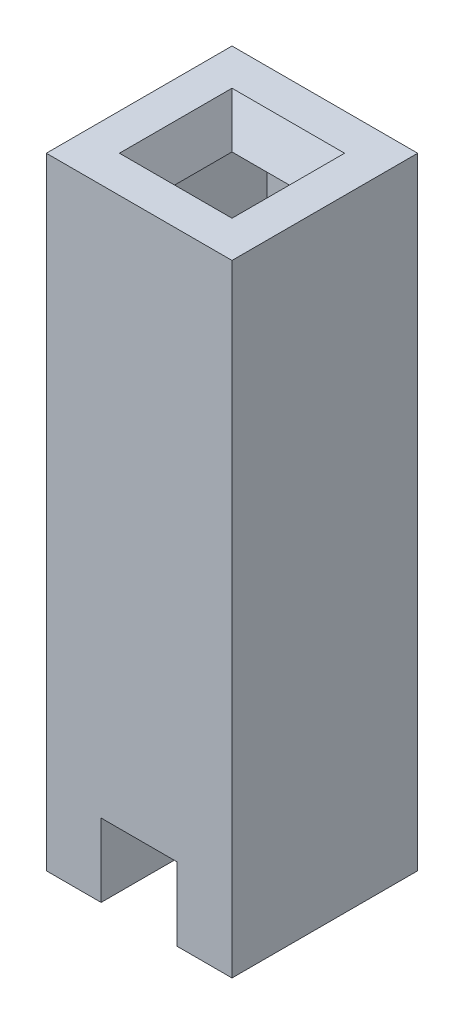
ISO-10303-21;
HEADER;
FILE_DESCRIPTION(('STEP AP214'),'2;1');
FILE_NAME('part.step','',(''),(''),'','','');
FILE_SCHEMA(('AUTOMOTIVE_DESIGN { 1 0 10303 214 1 1 1 1 }'));
ENDSEC;
DATA;
#1=APPLICATION_CONTEXT('core data for automotive mechanical design processes');
#2=APPLICATION_PROTOCOL_DEFINITION('international standard','automotive_design',2000,#1);
#3=PRODUCT_CONTEXT('',#1,'mechanical');
#4=PRODUCT('Part','Part','',(#3));
#5=PRODUCT_RELATED_PRODUCT_CATEGORY('part','',(#4));
#6=PRODUCT_DEFINITION_FORMATION('','',#4);
#7=PRODUCT_DEFINITION_CONTEXT('part definition',#1,'design');
#8=PRODUCT_DEFINITION('design','',#6,#7);
#9=PRODUCT_DEFINITION_SHAPE('','',#8);
#10=(LENGTH_UNIT() NAMED_UNIT(*) SI_UNIT(.MILLI.,.METRE.));
#11=(NAMED_UNIT(*) PLANE_ANGLE_UNIT() SI_UNIT($,.RADIAN.));
#12=(NAMED_UNIT(*) SI_UNIT($,.STERADIAN.) SOLID_ANGLE_UNIT());
#13=UNCERTAINTY_MEASURE_WITH_UNIT(LENGTH_MEASURE(1.E-05),#10,'distance_accuracy_value','');
#14=(GEOMETRIC_REPRESENTATION_CONTEXT(3) GLOBAL_UNCERTAINTY_ASSIGNED_CONTEXT((#13)) GLOBAL_UNIT_ASSIGNED_CONTEXT((#10,
#11,#12)) REPRESENTATION_CONTEXT('',''));
#15=CARTESIAN_POINT('',(0.,0.,0.));
#16=DIRECTION('',(0.,0.,1.));
#17=DIRECTION('',(1.,0.,0.));
#18=AXIS2_PLACEMENT_3D('',#15,#16,#17);
#19=CARTESIAN_POINT('',(-0.75,1.,2.54));
#20=DIRECTION('',(0.,1.,0.));
#21=DIRECTION('',(-1.,0.,0.));
#22=AXIS2_PLACEMENT_3D('',#19,#20,#21);
#23=PLANE('',#22);
#24=DIRECTION('',(0.,0.,-1.));
#25=VECTOR('',#24,1.);
#26=CARTESIAN_POINT('',(-1.79,1.,2.54));
#27=LINE('',#26,#25);
#28=CARTESIAN_POINT('',(-1.79,1.,2.54));
#29=VERTEX_POINT('',#28);
#30=CARTESIAN_POINT('',(-1.79,1.,2.27));
#31=VERTEX_POINT('',#30);
#32=EDGE_CURVE('E254',#29,#31,#27,.T.);
#33=ORIENTED_EDGE('',*,*,#32,.T.);
#34=DIRECTION('',(-1.,0.,0.));
#35=VECTOR('',#34,1.);
#36=CARTESIAN_POINT('',(-1.79,1.,2.27));
#37=LINE('',#36,#35);
#38=CARTESIAN_POINT('',(-0.75,1.,2.27));
#39=VERTEX_POINT('',#38);
#40=EDGE_CURVE('E195',#39,#31,#37,.T.);
#41=ORIENTED_EDGE('',*,*,#40,.F.);
#42=DIRECTION('',(0.,0.,-1.));
#43=VECTOR('',#42,1.);
#44=CARTESIAN_POINT('',(-0.75,1.,2.54));
#45=LINE('',#44,#43);
#46=CARTESIAN_POINT('',(-0.75,1.,2.54));
#47=VERTEX_POINT('',#46);
#48=EDGE_CURVE('E250',#47,#39,#45,.T.);
#49=ORIENTED_EDGE('',*,*,#48,.F.);
#50=DIRECTION('',(1.,0.,0.));
#51=VECTOR('',#50,1.);
#52=CARTESIAN_POINT('',(-0.75,1.,2.54));
#53=LINE('',#52,#51);
#54=EDGE_CURVE('E220',#29,#47,#53,.T.);
#55=ORIENTED_EDGE('',*,*,#54,.F.);
#56=EDGE_LOOP('',(#33,#41,#49,#55));
#57=FACE_BOUND('',#56,.T.);
#58=ADVANCED_FACE('F34',(#57),#23,.F.);
#59=CARTESIAN_POINT('',(0.,0.,2.54));
#60=DIRECTION('',(-1.,0.,0.));
#61=DIRECTION('',(0.,-1.,0.));
#62=AXIS2_PLACEMENT_3D('',#59,#60,#61);
#63=PLANE('',#62);
#64=DIRECTION('',(0.,1.,0.));
#65=VECTOR('',#64,1.);
#66=CARTESIAN_POINT('',(0.,0.,0.));
#67=LINE('',#66,#65);
#68=CARTESIAN_POINT('',(0.,0.,0.));
#69=VERTEX_POINT('',#68);
#70=CARTESIAN_POINT('',(0.,8.5,0.));
#71=VERTEX_POINT('',#70);
#72=EDGE_CURVE('E207',#69,#71,#67,.T.);
#73=ORIENTED_EDGE('',*,*,#72,.T.);
#74=DIRECTION('',(0.,0.,-1.));
#75=VECTOR('',#74,1.);
#76=CARTESIAN_POINT('',(0.,8.5,2.54));
#77=LINE('',#76,#75);
#78=CARTESIAN_POINT('',(0.,8.5,2.54));
#79=VERTEX_POINT('',#78);
#80=EDGE_CURVE('E12',#79,#71,#77,.T.);
#81=ORIENTED_EDGE('',*,*,#80,.F.);
#82=DIRECTION('',(0.,1.,0.));
#83=VECTOR('',#82,1.);
#84=CARTESIAN_POINT('',(0.,0.,2.54));
#85=LINE('',#84,#83);
#86=CARTESIAN_POINT('',(0.,0.,2.54));
#87=VERTEX_POINT('',#86);
#88=EDGE_CURVE('E208',#87,#79,#85,.T.);
#89=ORIENTED_EDGE('',*,*,#88,.F.);
#90=DIRECTION('',(0.,0.,-1.));
#91=VECTOR('',#90,1.);
#92=CARTESIAN_POINT('',(0.,0.,2.54));
#93=LINE('',#92,#91);
#94=EDGE_CURVE('E226',#87,#69,#93,.T.);
#95=ORIENTED_EDGE('',*,*,#94,.T.);
#96=EDGE_LOOP('',(#73,#81,#89,#95));
#97=FACE_BOUND('',#96,.T.);
#98=ADVANCED_FACE('F36',(#97),#63,.F.);
#99=CARTESIAN_POINT('',(0.,8.5,2.54));
#100=DIRECTION('',(0.,-1.,0.));
#101=DIRECTION('',(0.,0.,-1.));
#102=AXIS2_PLACEMENT_3D('',#99,#100,#101);
#103=PLANE('',#102);
#104=DIRECTION('',(-1.,0.,0.));
#105=VECTOR('',#104,1.);
#106=CARTESIAN_POINT('',(-0.5,8.5,0.5));
#107=LINE('',#106,#105);
#108=CARTESIAN_POINT('',(-0.5,8.5,0.5));
#109=VERTEX_POINT('',#108);
#110=CARTESIAN_POINT('',(-2.04,8.5,0.5));
#111=VERTEX_POINT('',#110);
#112=EDGE_CURVE('E170',#109,#111,#107,.T.);
#113=ORIENTED_EDGE('',*,*,#112,.F.);
#114=DIRECTION('',(0.,0.,-1.));
#115=VECTOR('',#114,1.);
#116=CARTESIAN_POINT('',(-0.5,8.5,2.04));
#117=LINE('',#116,#115);
#118=CARTESIAN_POINT('',(-0.5,8.5,2.04));
#119=VERTEX_POINT('',#118);
#120=EDGE_CURVE('E49',#119,#109,#117,.T.);
#121=ORIENTED_EDGE('',*,*,#120,.F.);
#122=DIRECTION('',(1.,0.,0.));
#123=VECTOR('',#122,1.);
#124=CARTESIAN_POINT('',(-2.04,8.5,2.04));
#125=LINE('',#124,#123);
#126=CARTESIAN_POINT('',(-2.04,8.5,2.04));
#127=VERTEX_POINT('',#126);
#128=EDGE_CURVE('E157',#127,#119,#125,.T.);
#129=ORIENTED_EDGE('',*,*,#128,.F.);
#130=DIRECTION('',(0.,0.,1.));
#131=VECTOR('',#130,1.);
#132=CARTESIAN_POINT('',(-2.04,8.5,0.5));
#133=LINE('',#132,#131);
#134=EDGE_CURVE('E165',#111,#127,#133,.T.);
#135=ORIENTED_EDGE('',*,*,#134,.F.);
#136=EDGE_LOOP('',(#113,#121,#129,#135));
#137=FACE_BOUND('',#136,.T.);
#138=DIRECTION('',(-1.,0.,0.));
#139=VECTOR('',#138,1.);
#140=CARTESIAN_POINT('',(0.,8.5,0.));
#141=LINE('',#140,#139);
#142=CARTESIAN_POINT('',(-2.54,8.5,0.));
#143=VERTEX_POINT('',#142);
#144=EDGE_CURVE('E229',#71,#143,#141,.T.);
#145=ORIENTED_EDGE('',*,*,#144,.T.);
#146=DIRECTION('',(0.,0.,-1.));
#147=VECTOR('',#146,1.);
#148=CARTESIAN_POINT('',(-2.54,8.5,2.54));
#149=LINE('',#148,#147);
#150=CARTESIAN_POINT('',(-2.54,8.5,2.54));
#151=VERTEX_POINT('',#150);
#152=EDGE_CURVE('E42',#151,#143,#149,.T.);
#153=ORIENTED_EDGE('',*,*,#152,.F.);
#154=DIRECTION('',(-1.,0.,0.));
#155=VECTOR('',#154,1.);
#156=CARTESIAN_POINT('',(0.,8.5,2.54));
#157=LINE('',#156,#155);
#158=EDGE_CURVE('E211',#79,#151,#157,.T.);
#159=ORIENTED_EDGE('',*,*,#158,.F.);
#160=ORIENTED_EDGE('',*,*,#80,.T.);
#161=EDGE_LOOP('',(#145,#153,#159,#160));
#162=FACE_BOUND('',#161,.T.);
#163=ADVANCED_FACE('F168',(#137,#162),#103,.F.);
#164=CARTESIAN_POINT('',(-2.54,0.,2.54));
#165=DIRECTION('',(1.,0.,0.));
#166=DIRECTION('',(0.,0.,-1.));
#167=AXIS2_PLACEMENT_3D('',#164,#165,#166);
#168=PLANE('',#167);
#169=DIRECTION('',(0.,-1.,0.));
#170=VECTOR('',#169,1.);
#171=CARTESIAN_POINT('',(-2.54,0.,0.));
#172=LINE('',#171,#170);
#173=CARTESIAN_POINT('',(-2.54,0.,0.));
#174=VERTEX_POINT('',#173);
#175=EDGE_CURVE('E231',#143,#174,#172,.T.);
#176=ORIENTED_EDGE('',*,*,#175,.T.);
#177=DIRECTION('',(0.,0.,-1.));
#178=VECTOR('',#177,1.);
#179=CARTESIAN_POINT('',(-2.54,0.,2.54));
#180=LINE('',#179,#178);
#181=CARTESIAN_POINT('',(-2.54,0.,2.54));
#182=VERTEX_POINT('',#181);
#183=EDGE_CURVE('E260',#182,#174,#180,.T.);
#184=ORIENTED_EDGE('',*,*,#183,.F.);
#185=DIRECTION('',(0.,-1.,0.));
#186=VECTOR('',#185,1.);
#187=CARTESIAN_POINT('',(-2.54,0.,2.54));
#188=LINE('',#187,#186);
#189=EDGE_CURVE('E214',#151,#182,#188,.T.);
#190=ORIENTED_EDGE('',*,*,#189,.F.);
#191=ORIENTED_EDGE('',*,*,#152,.T.);
#192=EDGE_LOOP('',(#176,#184,#190,#191));
#193=FACE_BOUND('',#192,.T.);
#194=ADVANCED_FACE('F267',(#193),#168,.F.);
#195=CARTESIAN_POINT('',(-1.79,0.,2.54));
#196=DIRECTION('',(0.,1.,0.));
#197=DIRECTION('',(-1.,0.,0.));
#198=AXIS2_PLACEMENT_3D('',#195,#196,#197);
#199=PLANE('',#198);
#200=DIRECTION('',(1.,0.,0.));
#201=VECTOR('',#200,1.);
#202=CARTESIAN_POINT('',(-1.79,0.,0.));
#203=LINE('',#202,#201);
#204=CARTESIAN_POINT('',(-1.79,0.,0.));
#205=VERTEX_POINT('',#204);
#206=EDGE_CURVE('E233',#174,#205,#203,.T.);
#207=ORIENTED_EDGE('',*,*,#206,.T.);
#208=DIRECTION('',(0.,0.,-1.));
#209=VECTOR('',#208,1.);
#210=CARTESIAN_POINT('',(-1.79,0.,2.54));
#211=LINE('',#210,#209);
#212=CARTESIAN_POINT('',(-1.79,0.,2.54));
#213=VERTEX_POINT('',#212);
#214=EDGE_CURVE('E257',#213,#205,#211,.T.);
#215=ORIENTED_EDGE('',*,*,#214,.F.);
#216=DIRECTION('',(1.,0.,0.));
#217=VECTOR('',#216,1.);
#218=CARTESIAN_POINT('',(-1.79,0.,2.54));
#219=LINE('',#218,#217);
#220=EDGE_CURVE('E216',#182,#213,#219,.T.);
#221=ORIENTED_EDGE('',*,*,#220,.F.);
#222=ORIENTED_EDGE('',*,*,#183,.T.);
#223=EDGE_LOOP('',(#207,#215,#221,#222));
#224=FACE_BOUND('',#223,.T.);
#225=ADVANCED_FACE('F277',(#224),#199,.F.);
#226=CARTESIAN_POINT('',(-1.79,0.,2.54));
#227=DIRECTION('',(-1.,0.,0.));
#228=DIRECTION('',(0.,0.,1.));
#229=AXIS2_PLACEMENT_3D('',#226,#227,#228);
#230=PLANE('',#229);
#231=DIRECTION('',(0.,1.,0.));
#232=VECTOR('',#231,1.);
#233=CARTESIAN_POINT('',(-1.79,0.,0.));
#234=LINE('',#233,#232);
#235=CARTESIAN_POINT('',(-1.79,1.,0.));
#236=VERTEX_POINT('',#235);
#237=EDGE_CURVE('E235',#205,#236,#234,.T.);
#238=ORIENTED_EDGE('',*,*,#237,.T.);
#239=CARTESIAN_POINT('',(-1.79,1.,0.27));
#240=VERTEX_POINT('',#239);
#241=EDGE_CURVE('E253',#240,#236,#27,.T.);
#242=ORIENTED_EDGE('',*,*,#241,.F.);
#243=DIRECTION('',(0.,-1.,0.));
#244=VECTOR('',#243,1.);
#245=CARTESIAN_POINT('',(-1.79,10.7542404485769,0.27));
#246=LINE('',#245,#244);
#247=CARTESIAN_POINT('',(-1.79,8.,0.27));
#248=VERTEX_POINT('',#247);
#249=EDGE_CURVE('E198',#248,#240,#246,.T.);
#250=ORIENTED_EDGE('',*,*,#249,.F.);
#251=DIRECTION('',(0.,0.,1.));
#252=VECTOR('',#251,1.);
#253=CARTESIAN_POINT('',(-1.79,8.,2.27));
#254=LINE('',#253,#252);
#255=CARTESIAN_POINT('',(-1.79,8.,2.27));
#256=VERTEX_POINT('',#255);
#257=EDGE_CURVE('E191',#248,#256,#254,.T.);
#258=ORIENTED_EDGE('',*,*,#257,.T.);
#259=DIRECTION('',(0.,-1.,0.));
#260=VECTOR('',#259,1.);
#261=CARTESIAN_POINT('',(-1.79,10.7542404485769,2.27));
#262=LINE('',#261,#260);
#263=EDGE_CURVE('E189',#256,#31,#262,.T.);
#264=ORIENTED_EDGE('',*,*,#263,.T.);
#265=ORIENTED_EDGE('',*,*,#32,.F.);
#266=DIRECTION('',(0.,1.,0.));
#267=VECTOR('',#266,1.);
#268=CARTESIAN_POINT('',(-1.79,0.,2.54));
#269=LINE('',#268,#267);
#270=EDGE_CURVE('E218',#213,#29,#269,.T.);
#271=ORIENTED_EDGE('',*,*,#270,.F.);
#272=ORIENTED_EDGE('',*,*,#214,.T.);
#273=EDGE_LOOP('',(#238,#242,#250,#258,#264,#265,#271,#272));
#274=FACE_BOUND('',#273,.T.);
#275=ADVANCED_FACE('F281',(#274),#230,.F.);
#276=CARTESIAN_POINT('',(-0.75,1.,0.27));
#277=VERTEX_POINT('',#276);
#278=CARTESIAN_POINT('',(-0.75,1.,0.));
#279=VERTEX_POINT('',#278);
#280=EDGE_CURVE('E249',#277,#279,#45,.T.);
#281=ORIENTED_EDGE('',*,*,#280,.F.);
#282=DIRECTION('',(1.,0.,0.));
#283=VECTOR('',#282,1.);
#284=CARTESIAN_POINT('',(-1.79,1.,0.27));
#285=LINE('',#284,#283);
#286=EDGE_CURVE('E164',#240,#277,#285,.T.);
#287=ORIENTED_EDGE('',*,*,#286,.F.);
#288=ORIENTED_EDGE('',*,*,#241,.T.);
#289=DIRECTION('',(1.,0.,0.));
#290=VECTOR('',#289,1.);
#291=CARTESIAN_POINT('',(-0.75,1.,0.));
#292=LINE('',#291,#290);
#293=EDGE_CURVE('E238',#236,#279,#292,.T.);
#294=ORIENTED_EDGE('',*,*,#293,.T.);
#295=EDGE_LOOP('',(#281,#287,#288,#294));
#296=FACE_BOUND('',#295,.T.);
#297=ADVANCED_FACE('F305',(#296),#23,.F.);
#298=CARTESIAN_POINT('',(-0.75,0.,2.54));
#299=DIRECTION('',(1.,0.,0.));
#300=DIRECTION('',(0.,0.,-1.));
#301=AXIS2_PLACEMENT_3D('',#298,#299,#300);
#302=PLANE('',#301);
#303=DIRECTION('',(0.,-1.,0.));
#304=VECTOR('',#303,1.);
#305=CARTESIAN_POINT('',(-0.75,0.,0.));
#306=LINE('',#305,#304);
#307=CARTESIAN_POINT('',(-0.75,0.,0.));
#308=VERTEX_POINT('',#307);
#309=EDGE_CURVE('E241',#279,#308,#306,.T.);
#310=ORIENTED_EDGE('',*,*,#309,.T.);
#311=DIRECTION('',(0.,0.,-1.));
#312=VECTOR('',#311,1.);
#313=CARTESIAN_POINT('',(-0.75,0.,2.54));
#314=LINE('',#313,#312);
#315=CARTESIAN_POINT('',(-0.75,0.,2.54));
#316=VERTEX_POINT('',#315);
#317=EDGE_CURVE('E246',#316,#308,#314,.T.);
#318=ORIENTED_EDGE('',*,*,#317,.F.);
#319=DIRECTION('',(0.,-1.,0.));
#320=VECTOR('',#319,1.);
#321=CARTESIAN_POINT('',(-0.75,0.,2.54));
#322=LINE('',#321,#320);
#323=EDGE_CURVE('E222',#47,#316,#322,.T.);
#324=ORIENTED_EDGE('',*,*,#323,.F.);
#325=ORIENTED_EDGE('',*,*,#48,.T.);
#326=DIRECTION('',(0.,-1.,0.));
#327=VECTOR('',#326,1.);
#328=CARTESIAN_POINT('',(-0.750000000000002,10.7542404485769,2.27));
#329=LINE('',#328,#327);
#330=CARTESIAN_POINT('',(-0.750000000000002,8.,2.27));
#331=VERTEX_POINT('',#330);
#332=EDGE_CURVE('E200',#331,#39,#329,.T.);
#333=ORIENTED_EDGE('',*,*,#332,.F.);
#334=DIRECTION('',(0.,0.,-1.));
#335=VECTOR('',#334,1.);
#336=CARTESIAN_POINT('',(-0.750000000000002,8.,2.27));
#337=LINE('',#336,#335);
#338=CARTESIAN_POINT('',(-0.750000000000002,8.,0.27));
#339=VERTEX_POINT('',#338);
#340=EDGE_CURVE('E186',#331,#339,#337,.T.);
#341=ORIENTED_EDGE('',*,*,#340,.T.);
#342=DIRECTION('',(0.,-1.,0.));
#343=VECTOR('',#342,1.);
#344=CARTESIAN_POINT('',(-0.750000000000002,10.7542404485769,0.27));
#345=LINE('',#344,#343);
#346=EDGE_CURVE('E202',#339,#277,#345,.T.);
#347=ORIENTED_EDGE('',*,*,#346,.T.);
#348=ORIENTED_EDGE('',*,*,#280,.T.);
#349=EDGE_LOOP('',(#310,#318,#324,#325,#333,#341,#347,#348));
#350=FACE_BOUND('',#349,.T.);
#351=ADVANCED_FACE('F300',(#350),#302,.F.);
#352=CARTESIAN_POINT('',(0.,0.,2.54));
#353=DIRECTION('',(0.,1.,0.));
#354=DIRECTION('',(-1.,0.,0.));
#355=AXIS2_PLACEMENT_3D('',#352,#353,#354);
#356=PLANE('',#355);
#357=DIRECTION('',(1.,0.,0.));
#358=VECTOR('',#357,1.);
#359=CARTESIAN_POINT('',(0.,0.,0.));
#360=LINE('',#359,#358);
#361=EDGE_CURVE('E212',#308,#69,#360,.T.);
#362=ORIENTED_EDGE('',*,*,#361,.T.);
#363=ORIENTED_EDGE('',*,*,#94,.F.);
#364=DIRECTION('',(1.,0.,0.));
#365=VECTOR('',#364,1.);
#366=CARTESIAN_POINT('',(0.,0.,2.54));
#367=LINE('',#366,#365);
#368=EDGE_CURVE('E224',#316,#87,#367,.T.);
#369=ORIENTED_EDGE('',*,*,#368,.F.);
#370=ORIENTED_EDGE('',*,*,#317,.T.);
#371=EDGE_LOOP('',(#362,#363,#369,#370));
#372=FACE_BOUND('',#371,.T.);
#373=ADVANCED_FACE('F295',(#372),#356,.F.);
#374=CARTESIAN_POINT('',(0.,0.,2.54));
#375=DIRECTION('',(0.,0.,1.));
#376=DIRECTION('',(1.,0.,0.));
#377=AXIS2_PLACEMENT_3D('',#374,#375,#376);
#378=PLANE('',#377);
#379=ORIENTED_EDGE('',*,*,#88,.T.);
#380=ORIENTED_EDGE('',*,*,#158,.T.);
#381=ORIENTED_EDGE('',*,*,#189,.T.);
#382=ORIENTED_EDGE('',*,*,#220,.T.);
#383=ORIENTED_EDGE('',*,*,#270,.T.);
#384=ORIENTED_EDGE('',*,*,#54,.T.);
#385=ORIENTED_EDGE('',*,*,#323,.T.);
#386=ORIENTED_EDGE('',*,*,#368,.T.);
#387=EDGE_LOOP('',(#379,#380,#381,#382,#383,#384,#385,#386));
#388=FACE_BOUND('',#387,.T.);
#389=ADVANCED_FACE('F286',(#388),#378,.T.);
#390=CARTESIAN_POINT('',(0.,0.,0.));
#391=DIRECTION('',(0.,0.,1.));
#392=DIRECTION('',(1.,0.,0.));
#393=AXIS2_PLACEMENT_3D('',#390,#391,#392);
#394=PLANE('',#393);
#395=ORIENTED_EDGE('',*,*,#72,.F.);
#396=ORIENTED_EDGE('',*,*,#361,.F.);
#397=ORIENTED_EDGE('',*,*,#309,.F.);
#398=ORIENTED_EDGE('',*,*,#293,.F.);
#399=ORIENTED_EDGE('',*,*,#237,.F.);
#400=ORIENTED_EDGE('',*,*,#206,.F.);
#401=ORIENTED_EDGE('',*,*,#175,.F.);
#402=ORIENTED_EDGE('',*,*,#144,.F.);
#403=EDGE_LOOP('',(#395,#396,#397,#398,#399,#400,#401,#402));
#404=FACE_BOUND('',#403,.T.);
#405=ADVANCED_FACE('F272',(#404),#394,.F.);
#406=CARTESIAN_POINT('',(-1.79,10.7542404485769,2.27));
#407=DIRECTION('',(0.,0.,1.));
#408=DIRECTION('',(1.,0.,0.));
#409=AXIS2_PLACEMENT_3D('',#406,#407,#408);
#410=PLANE('',#409);
#411=DIRECTION('',(1.,0.,0.));
#412=VECTOR('',#411,1.);
#413=CARTESIAN_POINT('',(-1.79,8.,2.27));
#414=LINE('',#413,#412);
#415=EDGE_CURVE('E188',#256,#331,#414,.T.);
#416=ORIENTED_EDGE('',*,*,#415,.T.);
#417=ORIENTED_EDGE('',*,*,#332,.T.);
#418=ORIENTED_EDGE('',*,*,#40,.T.);
#419=ORIENTED_EDGE('',*,*,#263,.F.);
#420=EDGE_LOOP('',(#416,#417,#418,#419));
#421=FACE_BOUND('',#420,.T.);
#422=ADVANCED_FACE('F318',(#421),#410,.F.);
#423=CARTESIAN_POINT('',(-1.79,10.7542404485769,0.27));
#424=DIRECTION('',(0.,0.,-1.));
#425=DIRECTION('',(-1.,0.,0.));
#426=AXIS2_PLACEMENT_3D('',#423,#424,#425);
#427=PLANE('',#426);
#428=DIRECTION('',(-1.,0.,0.));
#429=VECTOR('',#428,1.);
#430=CARTESIAN_POINT('',(-1.79,8.,0.27));
#431=LINE('',#430,#429);
#432=EDGE_CURVE('E193',#339,#248,#431,.T.);
#433=ORIENTED_EDGE('',*,*,#432,.T.);
#434=ORIENTED_EDGE('',*,*,#249,.T.);
#435=ORIENTED_EDGE('',*,*,#286,.T.);
#436=ORIENTED_EDGE('',*,*,#346,.F.);
#437=EDGE_LOOP('',(#433,#434,#435,#436));
#438=FACE_BOUND('',#437,.T.);
#439=ADVANCED_FACE('F310',(#438),#427,.F.);
#440=CARTESIAN_POINT('',(0.,8.,2.54));
#441=DIRECTION('',(0.,-1.,0.));
#442=DIRECTION('',(0.,0.,-1.));
#443=AXIS2_PLACEMENT_3D('',#440,#441,#442);
#444=PLANE('',#443);
#445=DIRECTION('',(0.,0.,-1.));
#446=VECTOR('',#445,1.);
#447=CARTESIAN_POINT('',(-0.754762724747216,8.,2.04));
#448=LINE('',#447,#446);
#449=CARTESIAN_POINT('',(-0.754762724747216,8.,1.78523727525278));
#450=VERTEX_POINT('',#449);
#451=CARTESIAN_POINT('',(-0.754762724747216,8.,0.754762724747215));
#452=VERTEX_POINT('',#451);
#453=EDGE_CURVE('E150',#450,#452,#448,.T.);
#454=ORIENTED_EDGE('',*,*,#453,.T.);
#455=DIRECTION('',(-1.,0.,0.));
#456=VECTOR('',#455,1.);
#457=CARTESIAN_POINT('',(-0.5,8.,0.754762724747215));
#458=LINE('',#457,#456);
#459=CARTESIAN_POINT('',(-1.78523727525278,8.,0.754762724747215));
#460=VERTEX_POINT('',#459);
#461=EDGE_CURVE('E173',#452,#460,#458,.T.);
#462=ORIENTED_EDGE('',*,*,#461,.T.);
#463=DIRECTION('',(0.,0.,1.));
#464=VECTOR('',#463,1.);
#465=CARTESIAN_POINT('',(-1.78523727525279,8.,0.5));
#466=LINE('',#465,#464);
#467=CARTESIAN_POINT('',(-1.78523727525279,8.,1.78523727525278));
#468=VERTEX_POINT('',#467);
#469=EDGE_CURVE('E153',#460,#468,#466,.T.);
#470=ORIENTED_EDGE('',*,*,#469,.T.);
#471=DIRECTION('',(1.,0.,0.));
#472=VECTOR('',#471,1.);
#473=CARTESIAN_POINT('',(-2.04,8.,1.78523727525278));
#474=LINE('',#473,#472);
#475=EDGE_CURVE('E154',#468,#450,#474,.T.);
#476=ORIENTED_EDGE('',*,*,#475,.T.);
#477=EDGE_LOOP('',(#454,#462,#470,#476));
#478=FACE_BOUND('',#477,.T.);
#479=ORIENTED_EDGE('',*,*,#257,.F.);
#480=ORIENTED_EDGE('',*,*,#432,.F.);
#481=ORIENTED_EDGE('',*,*,#340,.F.);
#482=ORIENTED_EDGE('',*,*,#415,.F.);
#483=EDGE_LOOP('',(#479,#480,#481,#482));
#484=FACE_BOUND('',#483,.T.);
#485=ADVANCED_FACE('F314',(#478,#484),#444,.T.);
#486=CARTESIAN_POINT('',(-0.5,8.5,2.04));
#487=DIRECTION('',(0.891006524188367,-0.453990499739548,0.));
#488=DIRECTION('',(0.453990499739548,0.891006524188367,0.));
#489=AXIS2_PLACEMENT_3D('',#486,#487,#488);
#490=PLANE('',#489);
#491=DIRECTION('',(0.413384109704205,0.811311996514364,0.413384109704205));
#492=VECTOR('',#491,1.);
#493=CARTESIAN_POINT('',(-0.763165090120145,7.983509429448,1.77683490987986));
#494=LINE('',#493,#492);
#495=EDGE_CURVE('E146',#450,#119,#494,.T.);
#496=ORIENTED_EDGE('',*,*,#495,.T.);
#497=ORIENTED_EDGE('',*,*,#120,.T.);
#498=DIRECTION('',(0.413384109704205,0.811311996514364,-0.413384109704205));
#499=VECTOR('',#498,1.);
#500=CARTESIAN_POINT('',(-0.763165090120145,7.983509429448,0.763165090120145));
#501=LINE('',#500,#499);
#502=EDGE_CURVE('E180',#452,#109,#501,.T.);
#503=ORIENTED_EDGE('',*,*,#502,.F.);
#504=ORIENTED_EDGE('',*,*,#453,.F.);
#505=EDGE_LOOP('',(#496,#497,#503,#504));
#506=FACE_BOUND('',#505,.T.);
#507=ADVANCED_FACE('F148',(#506),#490,.F.);
#508=CARTESIAN_POINT('',(-2.04,8.5,2.04));
#509=DIRECTION('',(0.,-0.453990499739548,0.891006524188367));
#510=DIRECTION('',(0.,-0.891006524188367,-0.453990499739548));
#511=AXIS2_PLACEMENT_3D('',#508,#509,#510);
#512=PLANE('',#511);
#513=DIRECTION('',(-0.413384109704205,0.811311996514364,0.413384109704205));
#514=VECTOR('',#513,1.);
#515=CARTESIAN_POINT('',(-1.77683490987986,7.983509429448,1.77683490987986));
#516=LINE('',#515,#514);
#517=EDGE_CURVE('E160',#468,#127,#516,.T.);
#518=ORIENTED_EDGE('',*,*,#517,.T.);
#519=ORIENTED_EDGE('',*,*,#128,.T.);
#520=ORIENTED_EDGE('',*,*,#495,.F.);
#521=ORIENTED_EDGE('',*,*,#475,.F.);
#522=EDGE_LOOP('',(#518,#519,#520,#521));
#523=FACE_BOUND('',#522,.T.);
#524=ADVANCED_FACE('F158',(#523),#512,.F.);
#525=CARTESIAN_POINT('',(-2.04,8.5,0.5));
#526=DIRECTION('',(-0.891006524188367,-0.453990499739548,0.));
#527=DIRECTION('',(0.453990499739548,-0.891006524188367,0.));
#528=AXIS2_PLACEMENT_3D('',#525,#526,#527);
#529=PLANE('',#528);
#530=DIRECTION('',(-0.413384109704205,0.811311996514364,-0.413384109704205));
#531=VECTOR('',#530,1.);
#532=CARTESIAN_POINT('',(-1.77683490987986,7.983509429448,0.763165090120145));
#533=LINE('',#532,#531);
#534=EDGE_CURVE('E57',#460,#111,#533,.T.);
#535=ORIENTED_EDGE('',*,*,#534,.T.);
#536=ORIENTED_EDGE('',*,*,#134,.T.);
#537=ORIENTED_EDGE('',*,*,#517,.F.);
#538=ORIENTED_EDGE('',*,*,#469,.F.);
#539=EDGE_LOOP('',(#535,#536,#537,#538));
#540=FACE_BOUND('',#539,.T.);
#541=ADVANCED_FACE('F433',(#540),#529,.F.);
#542=CARTESIAN_POINT('',(-0.5,8.5,0.5));
#543=DIRECTION('',(0.,-0.453990499739548,-0.891006524188367));
#544=DIRECTION('',(0.,0.891006524188367,-0.453990499739548));
#545=AXIS2_PLACEMENT_3D('',#542,#543,#544);
#546=PLANE('',#545);
#547=ORIENTED_EDGE('',*,*,#502,.T.);
#548=ORIENTED_EDGE('',*,*,#112,.T.);
#549=ORIENTED_EDGE('',*,*,#534,.F.);
#550=ORIENTED_EDGE('',*,*,#461,.F.);
#551=EDGE_LOOP('',(#547,#548,#549,#550));
#552=FACE_BOUND('',#551,.T.);
#553=ADVANCED_FACE('F440',(#552),#546,.F.);
#554=CLOSED_SHELL('',(#58,#98,#163,#194,#225,#275,#297,#351,#373,#389,#405,#422,#439,#485,#507,
#524,#541,#553));
#555=MANIFOLD_SOLID_BREP('B2',#554);
#556=ADVANCED_BREP_SHAPE_REPRESENTATION('',(#18,#555),#14);
#557=SHAPE_DEFINITION_REPRESENTATION(#9,#556);
ENDSEC;
END-ISO-10303-21;
